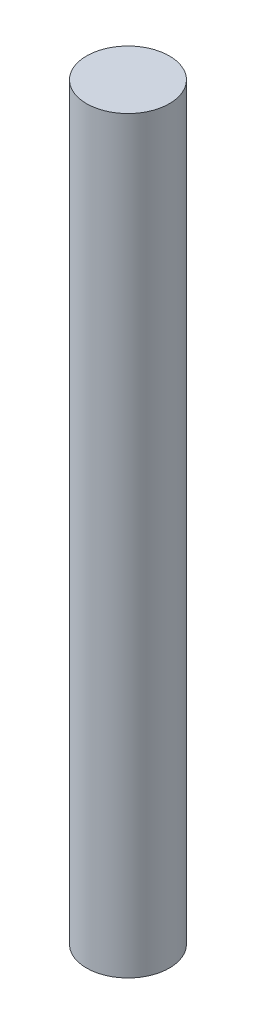
ISO-10303-21;
HEADER;
FILE_DESCRIPTION(('STEP AP214'),'2;1');
FILE_NAME('part.step','',(''),(''),'','','');
FILE_SCHEMA(('AUTOMOTIVE_DESIGN { 1 0 10303 214 1 1 1 1 }'));
ENDSEC;
DATA;
#1=APPLICATION_CONTEXT('core data for automotive mechanical design processes');
#2=APPLICATION_PROTOCOL_DEFINITION('international standard','automotive_design',2000,#1);
#3=PRODUCT_CONTEXT('',#1,'mechanical');
#4=PRODUCT('Part','Part','',(#3));
#5=PRODUCT_RELATED_PRODUCT_CATEGORY('part','',(#4));
#6=PRODUCT_DEFINITION_FORMATION('','',#4);
#7=PRODUCT_DEFINITION_CONTEXT('part definition',#1,'design');
#8=PRODUCT_DEFINITION('design','',#6,#7);
#9=PRODUCT_DEFINITION_SHAPE('','',#8);
#10=(LENGTH_UNIT() NAMED_UNIT(*) SI_UNIT(.MILLI.,.METRE.));
#11=(NAMED_UNIT(*) PLANE_ANGLE_UNIT() SI_UNIT($,.RADIAN.));
#12=(NAMED_UNIT(*) SI_UNIT($,.STERADIAN.) SOLID_ANGLE_UNIT());
#13=UNCERTAINTY_MEASURE_WITH_UNIT(LENGTH_MEASURE(1.E-05),#10,'distance_accuracy_value','');
#14=(GEOMETRIC_REPRESENTATION_CONTEXT(3) GLOBAL_UNCERTAINTY_ASSIGNED_CONTEXT((#13)) GLOBAL_UNIT_ASSIGNED_CONTEXT((#10,
#11,#12)) REPRESENTATION_CONTEXT('',''));
#15=CARTESIAN_POINT('',(0.,0.,0.));
#16=DIRECTION('',(0.,0.,1.));
#17=DIRECTION('',(1.,0.,0.));
#18=AXIS2_PLACEMENT_3D('',#15,#16,#17);
#19=CARTESIAN_POINT('',(0.,130.,0.));
#20=DIRECTION('',(0.,-1.,0.));
#21=DIRECTION('',(0.,0.,-1.));
#22=AXIS2_PLACEMENT_3D('',#19,#20,#21);
#23=CYLINDRICAL_SURFACE('',#22,7.1875);
#24=CARTESIAN_POINT('',(0.,130.,0.));
#25=DIRECTION('',(0.,1.,0.));
#26=DIRECTION('',(0.,0.,1.));
#27=AXIS2_PLACEMENT_3D('',#24,#25,#26);
#28=CIRCLE('',#27,7.1875);
#29=CARTESIAN_POINT('',(0.,130.,7.1875));
#30=VERTEX_POINT('',#29);
#31=EDGE_CURVE('E10',#30,#30,#28,.T.);
#32=ORIENTED_EDGE('',*,*,#31,.F.);
#33=EDGE_LOOP('',(#32));
#34=FACE_BOUND('',#33,.T.);
#35=CARTESIAN_POINT('',(0.,0.,0.));
#36=DIRECTION('',(0.,1.,0.));
#37=DIRECTION('',(0.,0.,1.));
#38=AXIS2_PLACEMENT_3D('',#35,#36,#37);
#39=CIRCLE('',#38,7.1875);
#40=CARTESIAN_POINT('',(0.,0.,7.1875));
#41=VERTEX_POINT('',#40);
#42=EDGE_CURVE('E46',#41,#41,#39,.T.);
#43=ORIENTED_EDGE('',*,*,#42,.T.);
#44=EDGE_LOOP('',(#43));
#45=FACE_BOUND('',#44,.T.);
#46=ADVANCED_FACE('F43',(#34,#45),#23,.T.);
#47=CARTESIAN_POINT('',(0.,130.,0.));
#48=DIRECTION('',(0.,1.,0.));
#49=DIRECTION('',(0.,0.,1.));
#50=AXIS2_PLACEMENT_3D('',#47,#48,#49);
#51=PLANE('',#50);
#52=ORIENTED_EDGE('',*,*,#31,.T.);
#53=EDGE_LOOP('',(#52));
#54=FACE_BOUND('',#53,.T.);
#55=ADVANCED_FACE('F60',(#54),#51,.T.);
#56=CARTESIAN_POINT('',(0.,0.,0.));
#57=DIRECTION('',(0.,1.,0.));
#58=DIRECTION('',(0.,0.,1.));
#59=AXIS2_PLACEMENT_3D('',#56,#57,#58);
#60=PLANE('',#59);
#61=ORIENTED_EDGE('',*,*,#42,.F.);
#62=EDGE_LOOP('',(#61));
#63=FACE_BOUND('',#62,.T.);
#64=ADVANCED_FACE('F58',(#63),#60,.F.);
#65=CLOSED_SHELL('',(#46,#55,#64));
#66=MANIFOLD_SOLID_BREP('B2',#65);
#67=ADVANCED_BREP_SHAPE_REPRESENTATION('',(#18,#66),#14);
#68=SHAPE_DEFINITION_REPRESENTATION(#9,#67);
ENDSEC;
END-ISO-10303-21;
